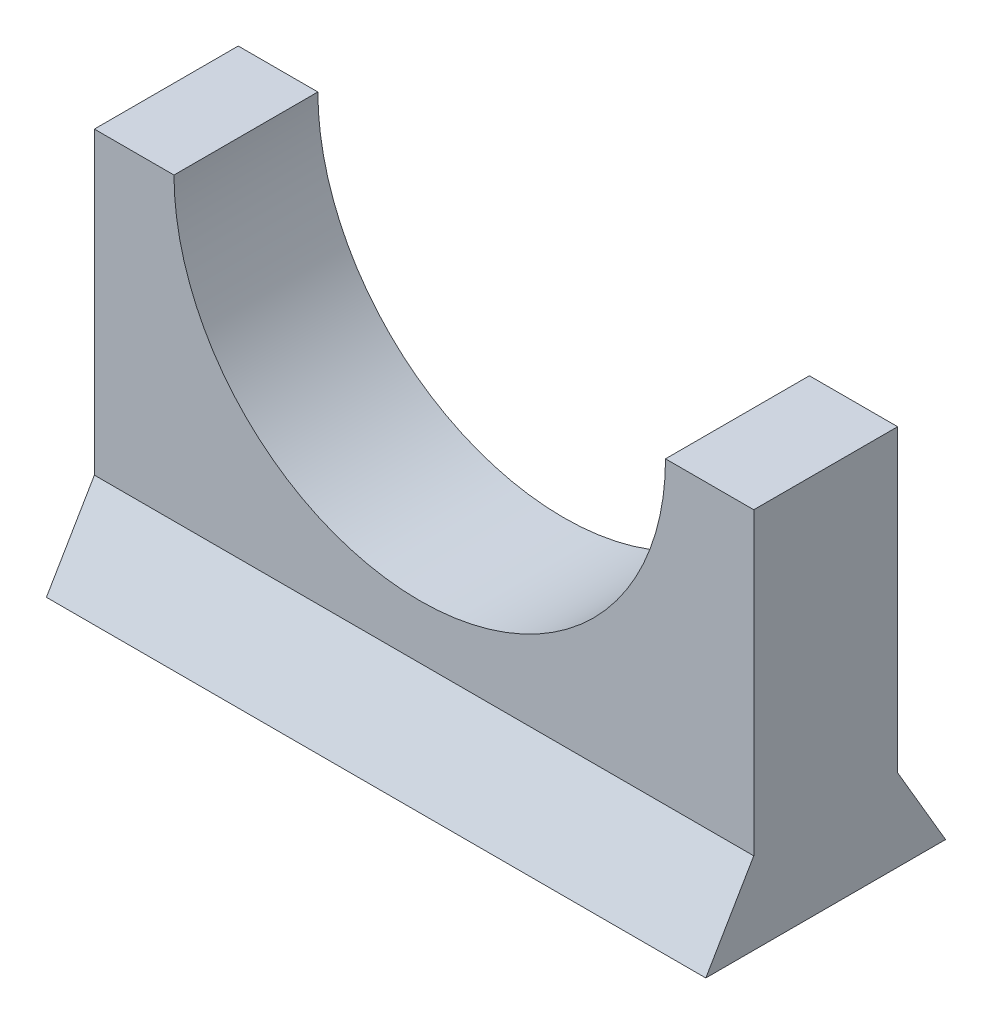
ISO-10303-21;
HEADER;
FILE_DESCRIPTION(('STEP AP214'),'2;1');
FILE_NAME('part.step','',(''),(''),'','','');
FILE_SCHEMA(('AUTOMOTIVE_DESIGN { 1 0 10303 214 1 1 1 1 }'));
ENDSEC;
DATA;
#1=APPLICATION_CONTEXT('core data for automotive mechanical design processes');
#2=APPLICATION_PROTOCOL_DEFINITION('international standard','automotive_design',2000,#1);
#3=PRODUCT_CONTEXT('',#1,'mechanical');
#4=PRODUCT('Part','Part','',(#3));
#5=PRODUCT_RELATED_PRODUCT_CATEGORY('part','',(#4));
#6=PRODUCT_DEFINITION_FORMATION('','',#4);
#7=PRODUCT_DEFINITION_CONTEXT('part definition',#1,'design');
#8=PRODUCT_DEFINITION('design','',#6,#7);
#9=PRODUCT_DEFINITION_SHAPE('','',#8);
#10=(LENGTH_UNIT() NAMED_UNIT(*) SI_UNIT(.MILLI.,.METRE.));
#11=(NAMED_UNIT(*) PLANE_ANGLE_UNIT() SI_UNIT($,.RADIAN.));
#12=(NAMED_UNIT(*) SI_UNIT($,.STERADIAN.) SOLID_ANGLE_UNIT());
#13=UNCERTAINTY_MEASURE_WITH_UNIT(LENGTH_MEASURE(1.E-05),#10,'distance_accuracy_value','');
#14=(GEOMETRIC_REPRESENTATION_CONTEXT(3) GLOBAL_UNCERTAINTY_ASSIGNED_CONTEXT((#13)) GLOBAL_UNIT_ASSIGNED_CONTEXT((#10,
#11,#12)) REPRESENTATION_CONTEXT('',''));
#15=CARTESIAN_POINT('',(0.,0.,0.));
#16=DIRECTION('',(0.,0.,1.));
#17=DIRECTION('',(1.,0.,0.));
#18=AXIS2_PLACEMENT_3D('',#15,#16,#17);
#19=CARTESIAN_POINT('',(0.,80.8351789932532,0.));
#20=DIRECTION('',(0.,1.,0.));
#21=DIRECTION('',(0.,0.,1.));
#22=AXIS2_PLACEMENT_3D('',#19,#20,#21);
#23=PLANE('',#22);
#24=DIRECTION('',(0.,0.,1.));
#25=VECTOR('',#24,1.);
#26=CARTESIAN_POINT('',(16.8653305713679,80.8351789932532,-22.86));
#27=LINE('',#26,#25);
#28=CARTESIAN_POINT('',(16.8653305713679,80.8351789932532,10.16));
#29=VERTEX_POINT('',#28);
#30=CARTESIAN_POINT('',(16.8653305713679,80.8351789932532,40.64));
#31=VERTEX_POINT('',#30);
#32=EDGE_CURVE('E11',#29,#31,#27,.T.);
#33=ORIENTED_EDGE('',*,*,#32,.F.);
#34=DIRECTION('',(-1.,0.,0.));
#35=VECTOR('',#34,1.);
#36=CARTESIAN_POINT('',(0.,80.8351789932532,10.16));
#37=LINE('',#36,#35);
#38=CARTESIAN_POINT('',(0.,80.8351789932532,10.16));
#39=VERTEX_POINT('',#38);
#40=EDGE_CURVE('E160',#29,#39,#37,.T.);
#41=ORIENTED_EDGE('',*,*,#40,.T.);
#42=DIRECTION('',(0.,0.,1.));
#43=VECTOR('',#42,1.);
#44=CARTESIAN_POINT('',(0.,80.8351789932532,0.));
#45=LINE('',#44,#43);
#46=CARTESIAN_POINT('',(0.,80.8351789932532,40.64));
#47=VERTEX_POINT('',#46);
#48=EDGE_CURVE('E113',#39,#47,#45,.T.);
#49=ORIENTED_EDGE('',*,*,#48,.T.);
#50=DIRECTION('',(1.,0.,0.));
#51=VECTOR('',#50,1.);
#52=CARTESIAN_POINT('',(0.,80.8351789932532,40.64));
#53=LINE('',#52,#51);
#54=EDGE_CURVE('E108',#47,#31,#53,.T.);
#55=ORIENTED_EDGE('',*,*,#54,.T.);
#56=EDGE_LOOP('',(#33,#41,#49,#55));
#57=FACE_BOUND('',#56,.T.);
#58=ADVANCED_FACE('F35',(#57),#23,.T.);
#59=CARTESIAN_POINT('',(0.,0.,50.8));
#60=DIRECTION('',(1.,0.,0.));
#61=DIRECTION('',(0.,0.,-1.));
#62=AXIS2_PLACEMENT_3D('',#59,#60,#61);
#63=PLANE('',#62);
#64=DIRECTION('',(0.,-0.862741425118127,0.505645363258819));
#65=VECTOR('',#64,1.);
#66=CARTESIAN_POINT('',(0.,22.1610530261562,37.8115965440347));
#67=LINE('',#66,#65);
#68=CARTESIAN_POINT('',(0.,17.3351789932532,40.64));
#69=VERTEX_POINT('',#68);
#70=CARTESIAN_POINT('',(0.,0.,50.8));
#71=VERTEX_POINT('',#70);
#72=EDGE_CURVE('E131',#69,#71,#67,.T.);
#73=ORIENTED_EDGE('',*,*,#72,.F.);
#74=DIRECTION('',(0.,-1.,0.));
#75=VECTOR('',#74,1.);
#76=CARTESIAN_POINT('',(0.,80.8351789932532,40.64));
#77=LINE('',#76,#75);
#78=EDGE_CURVE('E118',#47,#69,#77,.T.);
#79=ORIENTED_EDGE('',*,*,#78,.F.);
#80=ORIENTED_EDGE('',*,*,#48,.F.);
#81=DIRECTION('',(0.,-1.,0.));
#82=VECTOR('',#81,1.);
#83=CARTESIAN_POINT('',(0.,80.8351789932532,10.16));
#84=LINE('',#83,#82);
#85=CARTESIAN_POINT('',(0.,17.3351789932532,10.16));
#86=VERTEX_POINT('',#85);
#87=EDGE_CURVE('E124',#39,#86,#84,.T.);
#88=ORIENTED_EDGE('',*,*,#87,.T.);
#89=DIRECTION('',(0.,-0.862741425118127,-0.505645363258819));
#90=VECTOR('',#89,1.);
#91=CARTESIAN_POINT('',(0.,0.,0.));
#92=LINE('',#91,#90);
#93=CARTESIAN_POINT('',(0.,0.,0.));
#94=VERTEX_POINT('',#93);
#95=EDGE_CURVE('E133',#86,#94,#92,.T.);
#96=ORIENTED_EDGE('',*,*,#95,.T.);
#97=DIRECTION('',(0.,0.,-1.));
#98=VECTOR('',#97,1.);
#99=CARTESIAN_POINT('',(0.,0.,50.8));
#100=LINE('',#99,#98);
#101=EDGE_CURVE('E151',#71,#94,#100,.T.);
#102=ORIENTED_EDGE('',*,*,#101,.F.);
#103=EDGE_LOOP('',(#73,#79,#80,#88,#96,#102));
#104=FACE_BOUND('',#103,.T.);
#105=ADVANCED_FACE('F37',(#104),#63,.F.);
#106=CARTESIAN_POINT('',(139.7,0.,50.8));
#107=DIRECTION('',(-1.,0.,0.));
#108=DIRECTION('',(0.,0.,1.));
#109=AXIS2_PLACEMENT_3D('',#106,#107,#108);
#110=PLANE('',#109);
#111=DIRECTION('',(0.,-0.862741425118127,0.505645363258819));
#112=VECTOR('',#111,1.);
#113=CARTESIAN_POINT('',(139.7,22.1610530261562,37.8115965440347));
#114=LINE('',#113,#112);
#115=CARTESIAN_POINT('',(139.7,17.3351789932532,40.64));
#116=VERTEX_POINT('',#115);
#117=CARTESIAN_POINT('',(139.7,0.,50.8));
#118=VERTEX_POINT('',#117);
#119=EDGE_CURVE('E130',#116,#118,#114,.T.);
#120=ORIENTED_EDGE('',*,*,#119,.T.);
#121=DIRECTION('',(0.,0.,-1.));
#122=VECTOR('',#121,1.);
#123=CARTESIAN_POINT('',(139.7,0.,50.8));
#124=LINE('',#123,#122);
#125=CARTESIAN_POINT('',(139.7,0.,0.));
#126=VERTEX_POINT('',#125);
#127=EDGE_CURVE('E147',#118,#126,#124,.T.);
#128=ORIENTED_EDGE('',*,*,#127,.T.);
#129=DIRECTION('',(0.,-0.862741425118127,-0.505645363258819));
#130=VECTOR('',#129,1.);
#131=CARTESIAN_POINT('',(139.7,0.,0.));
#132=LINE('',#131,#130);
#133=CARTESIAN_POINT('',(139.7,17.3351789932532,10.16));
#134=VERTEX_POINT('',#133);
#135=EDGE_CURVE('E57',#134,#126,#132,.T.);
#136=ORIENTED_EDGE('',*,*,#135,.F.);
#137=DIRECTION('',(0.,-1.,0.));
#138=VECTOR('',#137,1.);
#139=CARTESIAN_POINT('',(139.7,80.8351789932532,10.16));
#140=LINE('',#139,#138);
#141=CARTESIAN_POINT('',(139.7,80.8351789932532,10.16));
#142=VERTEX_POINT('',#141);
#143=EDGE_CURVE('E127',#142,#134,#140,.T.);
#144=ORIENTED_EDGE('',*,*,#143,.F.);
#145=DIRECTION('',(0.,0.,-1.));
#146=VECTOR('',#145,1.);
#147=CARTESIAN_POINT('',(139.7,80.8351789932532,0.));
#148=LINE('',#147,#146);
#149=CARTESIAN_POINT('',(139.7,80.8351789932532,40.64));
#150=VERTEX_POINT('',#149);
#151=EDGE_CURVE('E161',#150,#142,#148,.T.);
#152=ORIENTED_EDGE('',*,*,#151,.F.);
#153=DIRECTION('',(0.,-1.,0.));
#154=VECTOR('',#153,1.);
#155=CARTESIAN_POINT('',(139.7,80.8351789932532,40.64));
#156=LINE('',#155,#154);
#157=EDGE_CURVE('E115',#150,#116,#156,.T.);
#158=ORIENTED_EDGE('',*,*,#157,.T.);
#159=EDGE_LOOP('',(#120,#128,#136,#144,#152,#158));
#160=FACE_BOUND('',#159,.T.);
#161=ADVANCED_FACE('F173',(#160),#110,.F.);
#162=CARTESIAN_POINT('',(0.,0.,50.8));
#163=DIRECTION('',(0.,1.,0.));
#164=DIRECTION('',(0.,0.,1.));
#165=AXIS2_PLACEMENT_3D('',#162,#163,#164);
#166=PLANE('',#165);
#167=DIRECTION('',(1.,0.,0.));
#168=VECTOR('',#167,1.);
#169=CARTESIAN_POINT('',(0.,0.,0.));
#170=LINE('',#169,#168);
#171=EDGE_CURVE('E142',#94,#126,#170,.T.);
#172=ORIENTED_EDGE('',*,*,#171,.T.);
#173=ORIENTED_EDGE('',*,*,#127,.F.);
#174=DIRECTION('',(1.,0.,0.));
#175=VECTOR('',#174,1.);
#176=CARTESIAN_POINT('',(0.,0.,50.8));
#177=LINE('',#176,#175);
#178=EDGE_CURVE('E145',#71,#118,#177,.T.);
#179=ORIENTED_EDGE('',*,*,#178,.F.);
#180=ORIENTED_EDGE('',*,*,#101,.T.);
#181=EDGE_LOOP('',(#172,#173,#179,#180));
#182=FACE_BOUND('',#181,.T.);
#183=ADVANCED_FACE('F177',(#182),#166,.F.);
#184=CARTESIAN_POINT('',(0.,22.1610530261562,37.8115965440347));
#185=DIRECTION('',(0.,0.505645363258819,0.862741425118127));
#186=DIRECTION('',(0.,-0.862741425118127,0.505645363258819));
#187=AXIS2_PLACEMENT_3D('',#184,#185,#186);
#188=PLANE('',#187);
#189=ORIENTED_EDGE('',*,*,#119,.F.);
#190=DIRECTION('',(1.,0.,0.));
#191=VECTOR('',#190,1.);
#192=CARTESIAN_POINT('',(0.,17.3351789932532,40.64));
#193=LINE('',#192,#191);
#194=EDGE_CURVE('E136',#69,#116,#193,.T.);
#195=ORIENTED_EDGE('',*,*,#194,.F.);
#196=ORIENTED_EDGE('',*,*,#72,.T.);
#197=ORIENTED_EDGE('',*,*,#178,.T.);
#198=EDGE_LOOP('',(#189,#195,#196,#197));
#199=FACE_BOUND('',#198,.T.);
#200=ADVANCED_FACE('F180',(#199),#188,.T.);
#201=CARTESIAN_POINT('',(0.,0.,0.));
#202=DIRECTION('',(0.,-0.505645363258819,0.862741425118127));
#203=DIRECTION('',(0.,-0.862741425118127,-0.505645363258819));
#204=AXIS2_PLACEMENT_3D('',#201,#202,#203);
#205=PLANE('',#204);
#206=ORIENTED_EDGE('',*,*,#135,.T.);
#207=ORIENTED_EDGE('',*,*,#171,.F.);
#208=ORIENTED_EDGE('',*,*,#95,.F.);
#209=DIRECTION('',(1.,0.,0.));
#210=VECTOR('',#209,1.);
#211=CARTESIAN_POINT('',(0.,17.3351789932532,10.16));
#212=LINE('',#211,#210);
#213=EDGE_CURVE('E140',#86,#134,#212,.T.);
#214=ORIENTED_EDGE('',*,*,#213,.T.);
#215=EDGE_LOOP('',(#206,#207,#208,#214));
#216=FACE_BOUND('',#215,.T.);
#217=ADVANCED_FACE('F178',(#216),#205,.F.);
#218=CARTESIAN_POINT('',(0.,80.8351789932532,10.16));
#219=DIRECTION('',(0.,0.,1.));
#220=DIRECTION('',(0.,-1.,0.));
#221=AXIS2_PLACEMENT_3D('',#218,#219,#220);
#222=PLANE('',#221);
#223=ORIENTED_EDGE('',*,*,#40,.F.);
#224=CARTESIAN_POINT('',(68.9353305713679,80.8351789932532,10.16));
#225=DIRECTION('',(0.,0.,1.));
#226=DIRECTION('',(0.,-1.,0.));
#227=AXIS2_PLACEMENT_3D('',#224,#225,#226);
#228=CIRCLE('',#227,52.07);
#229=CARTESIAN_POINT('',(121.005330571368,80.8351789932532,10.16));
#230=VERTEX_POINT('',#229);
#231=EDGE_CURVE('E99',#29,#230,#228,.T.);
#232=ORIENTED_EDGE('',*,*,#231,.T.);
#233=EDGE_CURVE('E157',#142,#230,#37,.T.);
#234=ORIENTED_EDGE('',*,*,#233,.F.);
#235=ORIENTED_EDGE('',*,*,#143,.T.);
#236=ORIENTED_EDGE('',*,*,#213,.F.);
#237=ORIENTED_EDGE('',*,*,#87,.F.);
#238=EDGE_LOOP('',(#223,#232,#234,#235,#236,#237));
#239=FACE_BOUND('',#238,.T.);
#240=ADVANCED_FACE('F156',(#239),#222,.F.);
#241=CARTESIAN_POINT('',(0.,80.8351789932532,40.64));
#242=DIRECTION('',(0.,0.,-1.));
#243=DIRECTION('',(0.,1.,0.));
#244=AXIS2_PLACEMENT_3D('',#241,#242,#243);
#245=PLANE('',#244);
#246=CARTESIAN_POINT('',(121.005330571368,80.8351789932532,40.64));
#247=VERTEX_POINT('',#246);
#248=EDGE_CURVE('E110',#247,#150,#53,.T.);
#249=ORIENTED_EDGE('',*,*,#248,.F.);
#250=CARTESIAN_POINT('',(68.9353305713679,80.8351789932532,40.64));
#251=DIRECTION('',(0.,0.,1.));
#252=DIRECTION('',(1.,0.,0.));
#253=AXIS2_PLACEMENT_3D('',#250,#251,#252);
#254=CIRCLE('',#253,52.07);
#255=EDGE_CURVE('E49',#31,#247,#254,.T.);
#256=ORIENTED_EDGE('',*,*,#255,.F.);
#257=ORIENTED_EDGE('',*,*,#54,.F.);
#258=ORIENTED_EDGE('',*,*,#78,.T.);
#259=ORIENTED_EDGE('',*,*,#194,.T.);
#260=ORIENTED_EDGE('',*,*,#157,.F.);
#261=EDGE_LOOP('',(#249,#256,#257,#258,#259,#260));
#262=FACE_BOUND('',#261,.T.);
#263=ADVANCED_FACE('F106',(#262),#245,.F.);
#264=DIRECTION('',(0.,0.,1.));
#265=VECTOR('',#264,1.);
#266=CARTESIAN_POINT('',(121.005330571368,80.8351789932532,-22.86));
#267=LINE('',#266,#265);
#268=EDGE_CURVE('E43',#247,#230,#267,.F.);
#269=ORIENTED_EDGE('',*,*,#268,.F.);
#270=ORIENTED_EDGE('',*,*,#248,.T.);
#271=ORIENTED_EDGE('',*,*,#151,.T.);
#272=ORIENTED_EDGE('',*,*,#233,.T.);
#273=EDGE_LOOP('',(#269,#270,#271,#272));
#274=FACE_BOUND('',#273,.T.);
#275=ADVANCED_FACE('F163',(#274),#23,.T.);
#276=CARTESIAN_POINT('',(68.9353305713679,80.8351789932532,-22.86));
#277=DIRECTION('',(0.,0.,1.));
#278=DIRECTION('',(1.,0.,0.));
#279=AXIS2_PLACEMENT_3D('',#276,#277,#278);
#280=CYLINDRICAL_SURFACE('',#279,52.07);
#281=ORIENTED_EDGE('',*,*,#32,.T.);
#282=ORIENTED_EDGE('',*,*,#255,.T.);
#283=ORIENTED_EDGE('',*,*,#268,.T.);
#284=ORIENTED_EDGE('',*,*,#231,.F.);
#285=EDGE_LOOP('',(#281,#282,#283,#284));
#286=FACE_BOUND('',#285,.T.);
#287=ADVANCED_FACE('F97',(#286),#280,.F.);
#288=CLOSED_SHELL('',(#58,#105,#161,#183,#200,#217,#240,#263,#275,#287));
#289=MANIFOLD_SOLID_BREP('B2',#288);
#290=ADVANCED_BREP_SHAPE_REPRESENTATION('',(#18,#289),#14);
#291=SHAPE_DEFINITION_REPRESENTATION(#9,#290);
ENDSEC;
END-ISO-10303-21;
